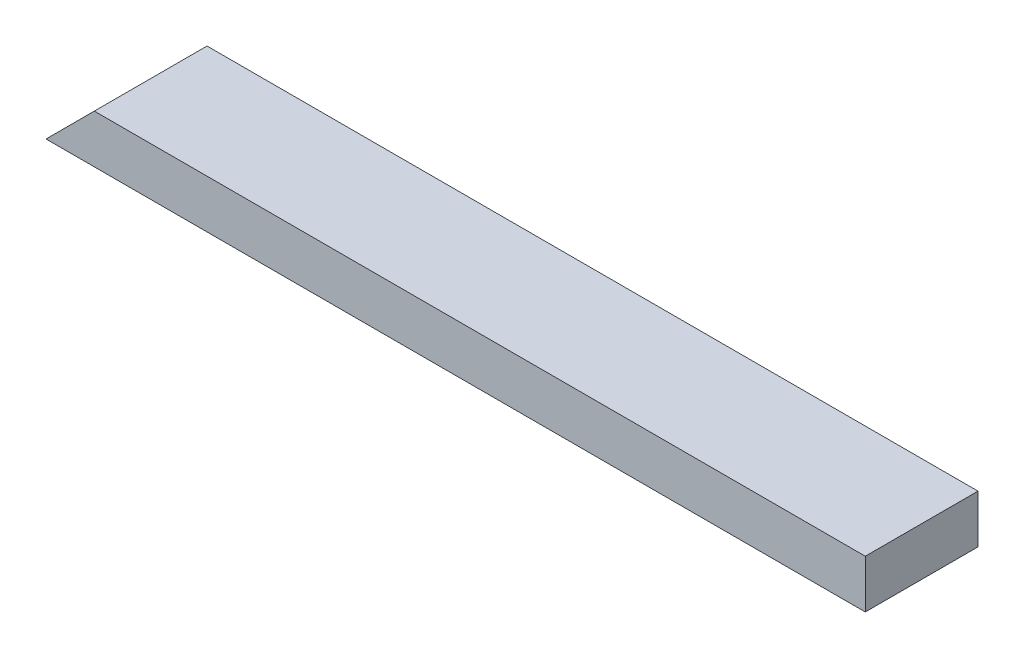
ISO-10303-21;
HEADER;
FILE_DESCRIPTION(('STEP AP214'),'2;1');
FILE_NAME('part.step','',(''),(''),'','','');
FILE_SCHEMA(('AUTOMOTIVE_DESIGN { 1 0 10303 214 1 1 1 1 }'));
ENDSEC;
DATA;
#1=APPLICATION_CONTEXT('core data for automotive mechanical design processes');
#2=APPLICATION_PROTOCOL_DEFINITION('international standard','automotive_design',2000,#1);
#3=PRODUCT_CONTEXT('',#1,'mechanical');
#4=PRODUCT('Part','Part','',(#3));
#5=PRODUCT_RELATED_PRODUCT_CATEGORY('part','',(#4));
#6=PRODUCT_DEFINITION_FORMATION('','',#4);
#7=PRODUCT_DEFINITION_CONTEXT('part definition',#1,'design');
#8=PRODUCT_DEFINITION('design','',#6,#7);
#9=PRODUCT_DEFINITION_SHAPE('','',#8);
#10=(LENGTH_UNIT() NAMED_UNIT(*) SI_UNIT(.MILLI.,.METRE.));
#11=(NAMED_UNIT(*) PLANE_ANGLE_UNIT() SI_UNIT($,.RADIAN.));
#12=(NAMED_UNIT(*) SI_UNIT($,.STERADIAN.) SOLID_ANGLE_UNIT());
#13=UNCERTAINTY_MEASURE_WITH_UNIT(LENGTH_MEASURE(1.E-05),#10,'distance_accuracy_value','');
#14=(GEOMETRIC_REPRESENTATION_CONTEXT(3) GLOBAL_UNCERTAINTY_ASSIGNED_CONTEXT((#13)) GLOBAL_UNIT_ASSIGNED_CONTEXT((#10,
#11,#12)) REPRESENTATION_CONTEXT('',''));
#15=CARTESIAN_POINT('',(0.,0.,0.));
#16=DIRECTION('',(0.,0.,1.));
#17=DIRECTION('',(1.,0.,0.));
#18=AXIS2_PLACEMENT_3D('',#15,#16,#17);
#19=CARTESIAN_POINT('',(0.,38.1,0.));
#20=DIRECTION('',(0.,0.,-1.));
#21=DIRECTION('',(-1.,0.,0.));
#22=AXIS2_PLACEMENT_3D('',#19,#20,#21);
#23=PLANE('',#22);
#24=DIRECTION('',(1.,0.,0.));
#25=VECTOR('',#24,1.);
#26=CARTESIAN_POINT('',(0.,38.1,0.));
#27=LINE('',#26,#25);
#28=CARTESIAN_POINT('',(38.1,38.1,0.));
#29=VERTEX_POINT('',#28);
#30=CARTESIAN_POINT('',(646.1125,38.1,0.));
#31=VERTEX_POINT('',#30);
#32=EDGE_CURVE('E94',#29,#31,#27,.T.);
#33=ORIENTED_EDGE('',*,*,#32,.F.);
#34=DIRECTION('',(0.707106781186547,0.707106781186547,0.));
#35=VECTOR('',#34,1.);
#36=CARTESIAN_POINT('',(0.,0.,0.));
#37=LINE('',#36,#35);
#38=CARTESIAN_POINT('',(0.,0.,0.));
#39=VERTEX_POINT('',#38);
#40=EDGE_CURVE('E88',#39,#29,#37,.T.);
#41=ORIENTED_EDGE('',*,*,#40,.F.);
#42=DIRECTION('',(1.,0.,0.));
#43=VECTOR('',#42,1.);
#44=CARTESIAN_POINT('',(0.,0.,0.));
#45=LINE('',#44,#43);
#46=CARTESIAN_POINT('',(646.1125,0.,0.));
#47=VERTEX_POINT('',#46);
#48=EDGE_CURVE('E98',#39,#47,#45,.T.);
#49=ORIENTED_EDGE('',*,*,#48,.T.);
#50=DIRECTION('',(0.,-1.,0.));
#51=VECTOR('',#50,1.);
#52=CARTESIAN_POINT('',(646.1125,38.1,0.));
#53=LINE('',#52,#51);
#54=EDGE_CURVE('E11',#31,#47,#53,.T.);
#55=ORIENTED_EDGE('',*,*,#54,.F.);
#56=EDGE_LOOP('',(#33,#41,#49,#55));
#57=FACE_BOUND('',#56,.T.);
#58=ADVANCED_FACE('F41',(#57),#23,.F.);
#59=CARTESIAN_POINT('',(646.1125,38.1,0.));
#60=DIRECTION('',(-1.,0.,0.));
#61=DIRECTION('',(0.,0.,1.));
#62=AXIS2_PLACEMENT_3D('',#59,#60,#61);
#63=PLANE('',#62);
#64=DIRECTION('',(0.,0.,-1.));
#65=VECTOR('',#64,1.);
#66=CARTESIAN_POINT('',(646.1125,0.,0.));
#67=LINE('',#66,#65);
#68=CARTESIAN_POINT('',(646.1125,0.,-88.9));
#69=VERTEX_POINT('',#68);
#70=EDGE_CURVE('E69',#47,#69,#67,.T.);
#71=ORIENTED_EDGE('',*,*,#70,.T.);
#72=DIRECTION('',(0.,-1.,0.));
#73=VECTOR('',#72,1.);
#74=CARTESIAN_POINT('',(646.1125,38.1,-88.9));
#75=LINE('',#74,#73);
#76=CARTESIAN_POINT('',(646.1125,38.1,-88.9));
#77=VERTEX_POINT('',#76);
#78=EDGE_CURVE('E49',#77,#69,#75,.T.);
#79=ORIENTED_EDGE('',*,*,#78,.F.);
#80=DIRECTION('',(0.,0.,-1.));
#81=VECTOR('',#80,1.);
#82=CARTESIAN_POINT('',(646.1125,38.1,0.));
#83=LINE('',#82,#81);
#84=EDGE_CURVE('E57',#31,#77,#83,.T.);
#85=ORIENTED_EDGE('',*,*,#84,.F.);
#86=ORIENTED_EDGE('',*,*,#54,.T.);
#87=EDGE_LOOP('',(#71,#79,#85,#86));
#88=FACE_BOUND('',#87,.T.);
#89=ADVANCED_FACE('F113',(#88),#63,.F.);
#90=CARTESIAN_POINT('',(0.,38.1,-88.9));
#91=DIRECTION('',(0.,0.,1.));
#92=DIRECTION('',(1.,0.,0.));
#93=AXIS2_PLACEMENT_3D('',#90,#91,#92);
#94=PLANE('',#93);
#95=DIRECTION('',(-1.,0.,0.));
#96=VECTOR('',#95,1.);
#97=CARTESIAN_POINT('',(0.,0.,-88.9));
#98=LINE('',#97,#96);
#99=CARTESIAN_POINT('',(0.,0.,-88.9));
#100=VERTEX_POINT('',#99);
#101=EDGE_CURVE('E91',#69,#100,#98,.T.);
#102=ORIENTED_EDGE('',*,*,#101,.T.);
#103=DIRECTION('',(0.707106781186547,0.707106781186547,0.));
#104=VECTOR('',#103,1.);
#105=CARTESIAN_POINT('',(0.,0.,-88.9));
#106=LINE('',#105,#104);
#107=CARTESIAN_POINT('',(38.1,38.1,-88.9));
#108=VERTEX_POINT('',#107);
#109=EDGE_CURVE('E76',#100,#108,#106,.T.);
#110=ORIENTED_EDGE('',*,*,#109,.T.);
#111=DIRECTION('',(-1.,0.,0.));
#112=VECTOR('',#111,1.);
#113=CARTESIAN_POINT('',(0.,38.1,-88.9));
#114=LINE('',#113,#112);
#115=EDGE_CURVE('E103',#77,#108,#114,.T.);
#116=ORIENTED_EDGE('',*,*,#115,.F.);
#117=ORIENTED_EDGE('',*,*,#78,.T.);
#118=EDGE_LOOP('',(#102,#110,#116,#117));
#119=FACE_BOUND('',#118,.T.);
#120=ADVANCED_FACE('F92',(#119),#94,.F.);
#121=CARTESIAN_POINT('',(0.,38.1,0.));
#122=DIRECTION('',(0.,-1.,0.));
#123=DIRECTION('',(0.,0.,-1.));
#124=AXIS2_PLACEMENT_3D('',#121,#122,#123);
#125=PLANE('',#124);
#126=ORIENTED_EDGE('',*,*,#115,.T.);
#127=DIRECTION('',(0.,0.,1.));
#128=VECTOR('',#127,1.);
#129=CARTESIAN_POINT('',(38.1,38.1,-88.9));
#130=LINE('',#129,#128);
#131=EDGE_CURVE('E85',#108,#29,#130,.T.);
#132=ORIENTED_EDGE('',*,*,#131,.T.);
#133=ORIENTED_EDGE('',*,*,#32,.T.);
#134=ORIENTED_EDGE('',*,*,#84,.T.);
#135=EDGE_LOOP('',(#126,#132,#133,#134));
#136=FACE_BOUND('',#135,.T.);
#137=ADVANCED_FACE('F111',(#136),#125,.F.);
#138=CARTESIAN_POINT('',(0.,0.,0.));
#139=DIRECTION('',(0.,-1.,0.));
#140=DIRECTION('',(0.,0.,-1.));
#141=AXIS2_PLACEMENT_3D('',#138,#139,#140);
#142=PLANE('',#141);
#143=DIRECTION('',(0.,0.,1.));
#144=VECTOR('',#143,1.);
#145=CARTESIAN_POINT('',(0.,0.,0.));
#146=LINE('',#145,#144);
#147=EDGE_CURVE('E82',#100,#39,#146,.T.);
#148=ORIENTED_EDGE('',*,*,#147,.F.);
#149=ORIENTED_EDGE('',*,*,#101,.F.);
#150=ORIENTED_EDGE('',*,*,#70,.F.);
#151=ORIENTED_EDGE('',*,*,#48,.F.);
#152=EDGE_LOOP('',(#148,#149,#150,#151));
#153=FACE_BOUND('',#152,.T.);
#154=ADVANCED_FACE('F97',(#153),#142,.T.);
#155=CARTESIAN_POINT('',(0.,0.,-88.9));
#156=DIRECTION('',(0.707106781186547,-0.707106781186547,0.));
#157=DIRECTION('',(0.707106781186548,0.707106781186548,0.));
#158=AXIS2_PLACEMENT_3D('',#155,#156,#157);
#159=PLANE('',#158);
#160=ORIENTED_EDGE('',*,*,#40,.T.);
#161=ORIENTED_EDGE('',*,*,#131,.F.);
#162=ORIENTED_EDGE('',*,*,#109,.F.);
#163=ORIENTED_EDGE('',*,*,#147,.T.);
#164=EDGE_LOOP('',(#160,#161,#162,#163));
#165=FACE_BOUND('',#164,.T.);
#166=ADVANCED_FACE('F79',(#165),#159,.F.);
#167=CLOSED_SHELL('',(#58,#89,#120,#137,#154,#166));
#168=MANIFOLD_SOLID_BREP('B2',#167);
#169=ADVANCED_BREP_SHAPE_REPRESENTATION('',(#18,#168),#14);
#170=SHAPE_DEFINITION_REPRESENTATION(#9,#169);
ENDSEC;
END-ISO-10303-21;
